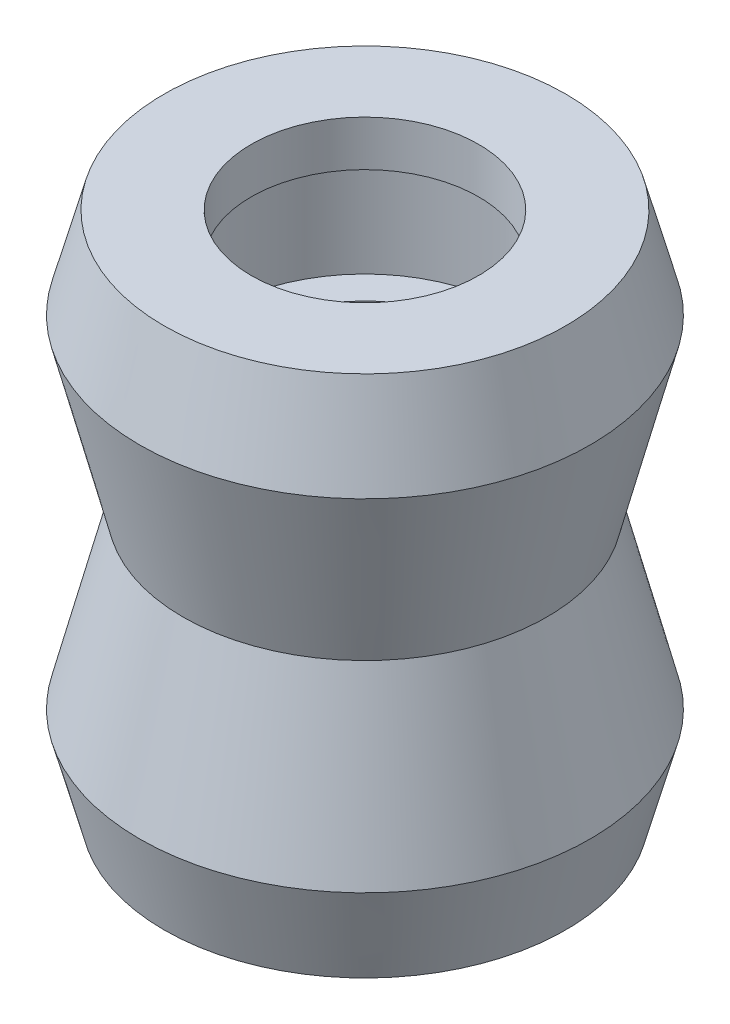
ISO-10303-21;
HEADER;
FILE_DESCRIPTION(('STEP AP214'),'2;1');
FILE_NAME('part.step','',(''),(''),'','','');
FILE_SCHEMA(('AUTOMOTIVE_DESIGN { 1 0 10303 214 1 1 1 1 }'));
ENDSEC;
DATA;
#1=APPLICATION_CONTEXT('core data for automotive mechanical design processes');
#2=APPLICATION_PROTOCOL_DEFINITION('international standard','automotive_design',2000,#1);
#3=PRODUCT_CONTEXT('',#1,'mechanical');
#4=PRODUCT('Part','Part','',(#3));
#5=PRODUCT_RELATED_PRODUCT_CATEGORY('part','',(#4));
#6=PRODUCT_DEFINITION_FORMATION('','',#4);
#7=PRODUCT_DEFINITION_CONTEXT('part definition',#1,'design');
#8=PRODUCT_DEFINITION('design','',#6,#7);
#9=PRODUCT_DEFINITION_SHAPE('','',#8);
#10=(LENGTH_UNIT() NAMED_UNIT(*) SI_UNIT(.MILLI.,.METRE.));
#11=(NAMED_UNIT(*) PLANE_ANGLE_UNIT() SI_UNIT($,.RADIAN.));
#12=(NAMED_UNIT(*) SI_UNIT($,.STERADIAN.) SOLID_ANGLE_UNIT());
#13=UNCERTAINTY_MEASURE_WITH_UNIT(LENGTH_MEASURE(1.E-05),#10,'distance_accuracy_value','');
#14=(GEOMETRIC_REPRESENTATION_CONTEXT(3) GLOBAL_UNCERTAINTY_ASSIGNED_CONTEXT((#13)) GLOBAL_UNIT_ASSIGNED_CONTEXT((#10,
#11,#12)) REPRESENTATION_CONTEXT('',''));
#15=CARTESIAN_POINT('',(0.,0.,0.));
#16=DIRECTION('',(0.,0.,1.));
#17=DIRECTION('',(1.,0.,0.));
#18=AXIS2_PLACEMENT_3D('',#15,#16,#17);
#19=CARTESIAN_POINT('',(8.82820323027549,11.5,0.));
#20=DIRECTION('',(0.,-1.,0.));
#21=DIRECTION('',(0.,0.,-1.));
#22=AXIS2_PLACEMENT_3D('',#19,#20,#21);
#23=PLANE('',#22);
#24=CARTESIAN_POINT('',(0.,11.5,0.));
#25=DIRECTION('',(0.,1.,0.));
#26=DIRECTION('',(0.,0.,1.));
#27=AXIS2_PLACEMENT_3D('',#24,#25,#26);
#28=CIRCLE('',#27,5.);
#29=CARTESIAN_POINT('',(0.,11.5,5.));
#30=VERTEX_POINT('',#29);
#31=EDGE_CURVE('E10',#30,#30,#28,.T.);
#32=ORIENTED_EDGE('',*,*,#31,.F.);
#33=EDGE_LOOP('',(#32));
#34=FACE_BOUND('',#33,.T.);
#35=CARTESIAN_POINT('',(0.,11.5,0.));
#36=DIRECTION('',(0.,1.,0.));
#37=DIRECTION('',(0.,0.,1.));
#38=AXIS2_PLACEMENT_3D('',#35,#36,#37);
#39=CIRCLE('',#38,8.82820323027549);
#40=CARTESIAN_POINT('',(0.,11.5,8.82820323027549));
#41=VERTEX_POINT('',#40);
#42=EDGE_CURVE('E72',#41,#41,#39,.T.);
#43=ORIENTED_EDGE('',*,*,#42,.T.);
#44=EDGE_LOOP('',(#43));
#45=FACE_BOUND('',#44,.T.);
#46=ADVANCED_FACE('F41',(#34,#45),#23,.F.);
#47=CARTESIAN_POINT('',(0.,11.727044646217,0.));
#48=DIRECTION('',(0.,1.,0.));
#49=DIRECTION('',(0.,0.,1.));
#50=AXIS2_PLACEMENT_3D('',#47,#48,#49);
#51=CYLINDRICAL_SURFACE('',#50,5.);
#52=CARTESIAN_POINT('',(0.,9.5,0.));
#53=DIRECTION('',(0.,1.,0.));
#54=DIRECTION('',(0.,0.,1.));
#55=AXIS2_PLACEMENT_3D('',#52,#53,#54);
#56=CIRCLE('',#55,5.);
#57=CARTESIAN_POINT('',(0.,9.5,5.));
#58=VERTEX_POINT('',#57);
#59=EDGE_CURVE('E48',#58,#58,#56,.T.);
#60=ORIENTED_EDGE('',*,*,#59,.F.);
#61=EDGE_LOOP('',(#60));
#62=FACE_BOUND('',#61,.T.);
#63=ORIENTED_EDGE('',*,*,#31,.T.);
#64=EDGE_LOOP('',(#63));
#65=FACE_BOUND('',#64,.T.);
#66=ADVANCED_FACE('F129',(#62,#65),#51,.F.);
#67=CARTESIAN_POINT('',(6.44999999999999,9.5,0.));
#68=DIRECTION('',(0.,1.,0.));
#69=DIRECTION('',(0.,0.,1.));
#70=AXIS2_PLACEMENT_3D('',#67,#68,#69);
#71=PLANE('',#70);
#72=CARTESIAN_POINT('',(0.,9.5,0.));
#73=DIRECTION('',(0.,1.,0.));
#74=DIRECTION('',(0.,0.,1.));
#75=AXIS2_PLACEMENT_3D('',#72,#73,#74);
#76=CIRCLE('',#75,6.44999999999999);
#77=CARTESIAN_POINT('',(0.,9.5,6.44999999999999));
#78=VERTEX_POINT('',#77);
#79=EDGE_CURVE('E53',#78,#78,#76,.T.);
#80=ORIENTED_EDGE('',*,*,#79,.F.);
#81=EDGE_LOOP('',(#80));
#82=FACE_BOUND('',#81,.T.);
#83=ORIENTED_EDGE('',*,*,#59,.T.);
#84=EDGE_LOOP('',(#83));
#85=FACE_BOUND('',#84,.T.);
#86=ADVANCED_FACE('F134',(#82,#85),#71,.F.);
#87=CARTESIAN_POINT('',(0.,11.727044646217,0.));
#88=DIRECTION('',(0.,1.,0.));
#89=DIRECTION('',(0.,0.,1.));
#90=AXIS2_PLACEMENT_3D('',#87,#88,#89);
#91=CYLINDRICAL_SURFACE('',#90,6.44999999999999);
#92=CARTESIAN_POINT('',(0.,4.5,0.));
#93=DIRECTION('',(0.,1.,0.));
#94=DIRECTION('',(0.,0.,1.));
#95=AXIS2_PLACEMENT_3D('',#92,#93,#94);
#96=CIRCLE('',#95,6.44999999999999);
#97=CARTESIAN_POINT('',(0.,4.5,6.44999999999999));
#98=VERTEX_POINT('',#97);
#99=EDGE_CURVE('E58',#98,#98,#96,.T.);
#100=ORIENTED_EDGE('',*,*,#99,.F.);
#101=EDGE_LOOP('',(#100));
#102=FACE_BOUND('',#101,.T.);
#103=ORIENTED_EDGE('',*,*,#79,.T.);
#104=EDGE_LOOP('',(#103));
#105=FACE_BOUND('',#104,.T.);
#106=ADVANCED_FACE('F249',(#102,#105),#91,.F.);
#107=CARTESIAN_POINT('',(6.44999999999999,4.5,0.));
#108=DIRECTION('',(0.,-1.,0.));
#109=DIRECTION('',(0.,0.,-1.));
#110=AXIS2_PLACEMENT_3D('',#107,#108,#109);
#111=PLANE('',#110);
#112=CARTESIAN_POINT('',(0.,4.5,0.));
#113=DIRECTION('',(0.,1.,0.));
#114=DIRECTION('',(0.,0.,1.));
#115=AXIS2_PLACEMENT_3D('',#112,#113,#114);
#116=CIRCLE('',#115,5.);
#117=CARTESIAN_POINT('',(0.,4.5,5.));
#118=VERTEX_POINT('',#117);
#119=EDGE_CURVE('E64',#118,#118,#116,.T.);
#120=ORIENTED_EDGE('',*,*,#119,.F.);
#121=EDGE_LOOP('',(#120));
#122=FACE_BOUND('',#121,.T.);
#123=ORIENTED_EDGE('',*,*,#99,.T.);
#124=EDGE_LOOP('',(#123));
#125=FACE_BOUND('',#124,.T.);
#126=ADVANCED_FACE('F240',(#122,#125),#111,.F.);
#127=CARTESIAN_POINT('',(0.,11.727044646217,0.));
#128=DIRECTION('',(0.,1.,0.));
#129=DIRECTION('',(0.,0.,1.));
#130=AXIS2_PLACEMENT_3D('',#127,#128,#129);
#131=CYLINDRICAL_SURFACE('',#130,5.);
#132=ORIENTED_EDGE('',*,*,#119,.T.);
#133=EDGE_LOOP('',(#132));
#134=FACE_BOUND('',#133,.T.);
#135=CARTESIAN_POINT('',(0.,-4.5,0.));
#136=DIRECTION('',(0.,1.,0.));
#137=DIRECTION('',(0.,0.,1.));
#138=AXIS2_PLACEMENT_3D('',#135,#136,#137);
#139=CIRCLE('',#138,5.);
#140=CARTESIAN_POINT('',(0.,-4.5,5.));
#141=VERTEX_POINT('',#140);
#142=EDGE_CURVE('E92',#141,#141,#139,.T.);
#143=ORIENTED_EDGE('',*,*,#142,.F.);
#144=EDGE_LOOP('',(#143));
#145=FACE_BOUND('',#144,.T.);
#146=ADVANCED_FACE('F143',(#134,#145),#131,.F.);
#147=CARTESIAN_POINT('',(0.,0.,0.));
#148=DIRECTION('',(0.,1.,0.));
#149=DIRECTION('',(0.,0.,1.));
#150=AXIS2_PLACEMENT_3D('',#147,#148,#149);
#151=CONICAL_SURFACE('',#150,8.,0.248113449096677);
#152=CARTESIAN_POINT('',(0.,7.5,0.));
#153=DIRECTION('',(0.,1.,0.));
#154=DIRECTION('',(0.,0.,1.));
#155=AXIS2_PLACEMENT_3D('',#152,#153,#154);
#156=CIRCLE('',#155,9.9);
#157=CARTESIAN_POINT('',(0.,7.5,9.9));
#158=VERTEX_POINT('',#157);
#159=EDGE_CURVE('E68',#158,#158,#156,.T.);
#160=ORIENTED_EDGE('',*,*,#159,.F.);
#161=EDGE_LOOP('',(#160));
#162=FACE_BOUND('',#161,.T.);
#163=CARTESIAN_POINT('',(0.,0.,0.));
#164=DIRECTION('',(0.,1.,0.));
#165=DIRECTION('',(0.,0.,1.));
#166=AXIS2_PLACEMENT_3D('',#163,#164,#165);
#167=CIRCLE('',#166,8.);
#168=CARTESIAN_POINT('',(0.,0.,8.));
#169=VERTEX_POINT('',#168);
#170=EDGE_CURVE('E96',#169,#169,#167,.T.);
#171=ORIENTED_EDGE('',*,*,#170,.T.);
#172=EDGE_LOOP('',(#171));
#173=FACE_BOUND('',#172,.T.);
#174=ADVANCED_FACE('F125',(#162,#173),#151,.T.);
#175=CARTESIAN_POINT('',(0.,7.5,0.));
#176=DIRECTION('',(0.,-1.,0.));
#177=DIRECTION('',(0.,0.,-1.));
#178=AXIS2_PLACEMENT_3D('',#175,#176,#177);
#179=CONICAL_SURFACE('',#178,9.9,0.261799387799154);
#180=ORIENTED_EDGE('',*,*,#42,.F.);
#181=EDGE_LOOP('',(#180));
#182=FACE_BOUND('',#181,.T.);
#183=ORIENTED_EDGE('',*,*,#159,.T.);
#184=EDGE_LOOP('',(#183));
#185=FACE_BOUND('',#184,.T.);
#186=ADVANCED_FACE('F115',(#182,#185),#179,.T.);
#187=CARTESIAN_POINT('',(8.82820323027549,-11.5,0.));
#188=DIRECTION('',(0.,1.,0.));
#189=DIRECTION('',(0.,0.,-1.));
#190=AXIS2_PLACEMENT_3D('',#187,#188,#189);
#191=PLANE('',#190);
#192=CARTESIAN_POINT('',(0.,-11.5,0.));
#193=DIRECTION('',(0.,1.,0.));
#194=DIRECTION('',(0.,0.,1.));
#195=AXIS2_PLACEMENT_3D('',#192,#193,#194);
#196=CIRCLE('',#195,5.);
#197=CARTESIAN_POINT('',(0.,-11.5,5.));
#198=VERTEX_POINT('',#197);
#199=EDGE_CURVE('E76',#198,#198,#196,.T.);
#200=ORIENTED_EDGE('',*,*,#199,.T.);
#201=EDGE_LOOP('',(#200));
#202=FACE_BOUND('',#201,.T.);
#203=CARTESIAN_POINT('',(0.,-11.5,0.));
#204=DIRECTION('',(0.,1.,0.));
#205=DIRECTION('',(0.,0.,1.));
#206=AXIS2_PLACEMENT_3D('',#203,#204,#205);
#207=CIRCLE('',#206,8.82820323027549);
#208=CARTESIAN_POINT('',(0.,-11.5,8.82820323027549));
#209=VERTEX_POINT('',#208);
#210=EDGE_CURVE('E104',#209,#209,#207,.T.);
#211=ORIENTED_EDGE('',*,*,#210,.F.);
#212=EDGE_LOOP('',(#211));
#213=FACE_BOUND('',#212,.T.);
#214=ADVANCED_FACE('F112',(#202,#213),#191,.F.);
#215=CARTESIAN_POINT('',(0.,-11.727044646217,0.));
#216=DIRECTION('',(0.,-1.,0.));
#217=DIRECTION('',(0.,0.,1.));
#218=AXIS2_PLACEMENT_3D('',#215,#216,#217);
#219=CYLINDRICAL_SURFACE('',#218,5.);
#220=CARTESIAN_POINT('',(0.,-9.5,0.));
#221=DIRECTION('',(0.,1.,0.));
#222=DIRECTION('',(0.,0.,1.));
#223=AXIS2_PLACEMENT_3D('',#220,#221,#222);
#224=CIRCLE('',#223,5.);
#225=CARTESIAN_POINT('',(0.,-9.5,5.));
#226=VERTEX_POINT('',#225);
#227=EDGE_CURVE('E80',#226,#226,#224,.T.);
#228=ORIENTED_EDGE('',*,*,#227,.T.);
#229=EDGE_LOOP('',(#228));
#230=FACE_BOUND('',#229,.T.);
#231=ORIENTED_EDGE('',*,*,#199,.F.);
#232=EDGE_LOOP('',(#231));
#233=FACE_BOUND('',#232,.T.);
#234=ADVANCED_FACE('F114',(#230,#233),#219,.F.);
#235=CARTESIAN_POINT('',(6.44999999999999,-9.5,0.));
#236=DIRECTION('',(0.,-1.,0.));
#237=DIRECTION('',(0.,0.,1.));
#238=AXIS2_PLACEMENT_3D('',#235,#236,#237);
#239=PLANE('',#238);
#240=CARTESIAN_POINT('',(0.,-9.5,0.));
#241=DIRECTION('',(0.,1.,0.));
#242=DIRECTION('',(0.,0.,1.));
#243=AXIS2_PLACEMENT_3D('',#240,#241,#242);
#244=CIRCLE('',#243,6.44999999999999);
#245=CARTESIAN_POINT('',(0.,-9.5,6.44999999999999));
#246=VERTEX_POINT('',#245);
#247=EDGE_CURVE('E84',#246,#246,#244,.T.);
#248=ORIENTED_EDGE('',*,*,#247,.T.);
#249=EDGE_LOOP('',(#248));
#250=FACE_BOUND('',#249,.T.);
#251=ORIENTED_EDGE('',*,*,#227,.F.);
#252=EDGE_LOOP('',(#251));
#253=FACE_BOUND('',#252,.T.);
#254=ADVANCED_FACE('F122',(#250,#253),#239,.F.);
#255=CARTESIAN_POINT('',(0.,-11.727044646217,0.));
#256=DIRECTION('',(0.,-1.,0.));
#257=DIRECTION('',(0.,0.,1.));
#258=AXIS2_PLACEMENT_3D('',#255,#256,#257);
#259=CYLINDRICAL_SURFACE('',#258,6.44999999999999);
#260=CARTESIAN_POINT('',(0.,-4.5,0.));
#261=DIRECTION('',(0.,1.,0.));
#262=DIRECTION('',(0.,0.,1.));
#263=AXIS2_PLACEMENT_3D('',#260,#261,#262);
#264=CIRCLE('',#263,6.44999999999999);
#265=CARTESIAN_POINT('',(0.,-4.5,6.44999999999999));
#266=VERTEX_POINT('',#265);
#267=EDGE_CURVE('E88',#266,#266,#264,.T.);
#268=ORIENTED_EDGE('',*,*,#267,.T.);
#269=EDGE_LOOP('',(#268));
#270=FACE_BOUND('',#269,.T.);
#271=ORIENTED_EDGE('',*,*,#247,.F.);
#272=EDGE_LOOP('',(#271));
#273=FACE_BOUND('',#272,.T.);
#274=ADVANCED_FACE('F157',(#270,#273),#259,.F.);
#275=CARTESIAN_POINT('',(6.44999999999999,-4.5,0.));
#276=DIRECTION('',(0.,1.,0.));
#277=DIRECTION('',(0.,0.,-1.));
#278=AXIS2_PLACEMENT_3D('',#275,#276,#277);
#279=PLANE('',#278);
#280=ORIENTED_EDGE('',*,*,#142,.T.);
#281=EDGE_LOOP('',(#280));
#282=FACE_BOUND('',#281,.T.);
#283=ORIENTED_EDGE('',*,*,#267,.F.);
#284=EDGE_LOOP('',(#283));
#285=FACE_BOUND('',#284,.T.);
#286=ADVANCED_FACE('F149',(#282,#285),#279,.F.);
#287=CARTESIAN_POINT('',(0.,0.,0.));
#288=DIRECTION('',(0.,-1.,0.));
#289=DIRECTION('',(0.,0.,1.));
#290=AXIS2_PLACEMENT_3D('',#287,#288,#289);
#291=CONICAL_SURFACE('',#290,8.,0.248113449096677);
#292=CARTESIAN_POINT('',(0.,-7.5,0.));
#293=DIRECTION('',(0.,1.,0.));
#294=DIRECTION('',(0.,0.,1.));
#295=AXIS2_PLACEMENT_3D('',#292,#293,#294);
#296=CIRCLE('',#295,9.9);
#297=CARTESIAN_POINT('',(0.,-7.5,9.9));
#298=VERTEX_POINT('',#297);
#299=EDGE_CURVE('E100',#298,#298,#296,.T.);
#300=ORIENTED_EDGE('',*,*,#299,.T.);
#301=EDGE_LOOP('',(#300));
#302=FACE_BOUND('',#301,.T.);
#303=ORIENTED_EDGE('',*,*,#170,.F.);
#304=EDGE_LOOP('',(#303));
#305=FACE_BOUND('',#304,.T.);
#306=ADVANCED_FACE('F147',(#302,#305),#291,.T.);
#307=CARTESIAN_POINT('',(0.,-7.5,0.));
#308=DIRECTION('',(0.,1.,0.));
#309=DIRECTION('',(0.,0.,-1.));
#310=AXIS2_PLACEMENT_3D('',#307,#308,#309);
#311=CONICAL_SURFACE('',#310,9.9,0.261799387799154);
#312=ORIENTED_EDGE('',*,*,#210,.T.);
#313=EDGE_LOOP('',(#312));
#314=FACE_BOUND('',#313,.T.);
#315=ORIENTED_EDGE('',*,*,#299,.F.);
#316=EDGE_LOOP('',(#315));
#317=FACE_BOUND('',#316,.T.);
#318=ADVANCED_FACE('F109',(#314,#317),#311,.T.);
#319=CLOSED_SHELL('',(#46,#66,#86,#106,#126,#146,#174,#186,#214,#234,#254,#274,#286,#306,#318));
#320=MANIFOLD_SOLID_BREP('B2',#319);
#321=ADVANCED_BREP_SHAPE_REPRESENTATION('',(#18,#320),#14);
#322=SHAPE_DEFINITION_REPRESENTATION(#9,#321);
ENDSEC;
END-ISO-10303-21;
